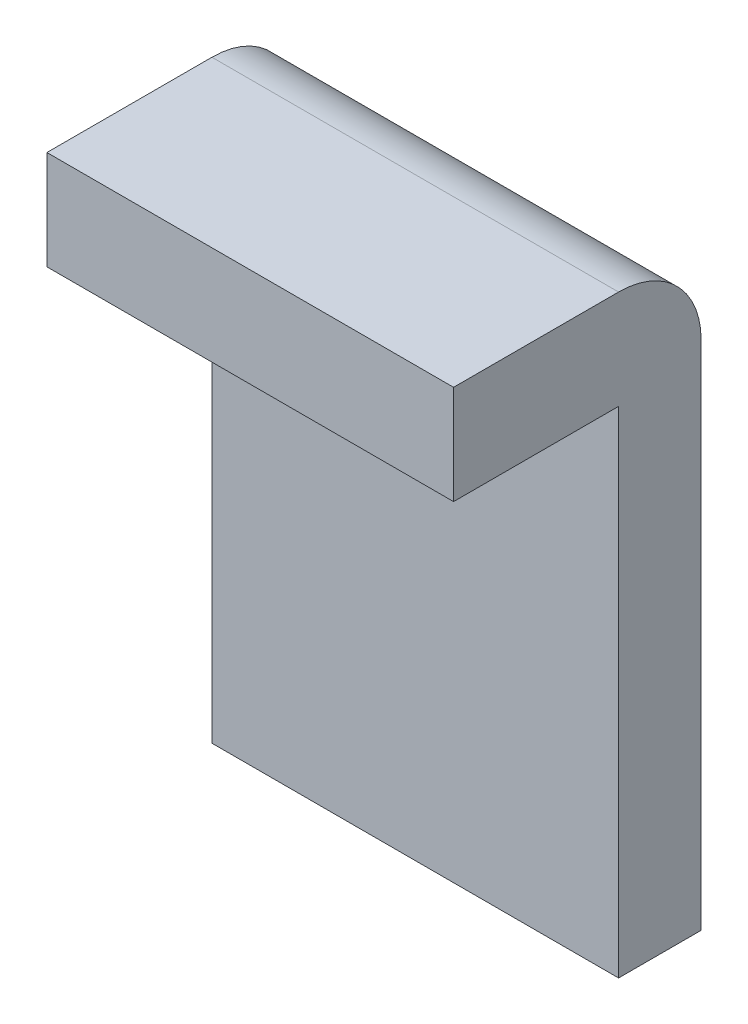
ISO-10303-21;
HEADER;
FILE_DESCRIPTION(('STEP AP214'),'2;1');
FILE_NAME('part.step','',(''),(''),'','','');
FILE_SCHEMA(('AUTOMOTIVE_DESIGN { 1 0 10303 214 1 1 1 1 }'));
ENDSEC;
DATA;
#1=APPLICATION_CONTEXT('core data for automotive mechanical design processes');
#2=APPLICATION_PROTOCOL_DEFINITION('international standard','automotive_design',2000,#1);
#3=PRODUCT_CONTEXT('',#1,'mechanical');
#4=PRODUCT('Part','Part','',(#3));
#5=PRODUCT_RELATED_PRODUCT_CATEGORY('part','',(#4));
#6=PRODUCT_DEFINITION_FORMATION('','',#4);
#7=PRODUCT_DEFINITION_CONTEXT('part definition',#1,'design');
#8=PRODUCT_DEFINITION('design','',#6,#7);
#9=PRODUCT_DEFINITION_SHAPE('','',#8);
#10=(LENGTH_UNIT() NAMED_UNIT(*) SI_UNIT(.MILLI.,.METRE.));
#11=(NAMED_UNIT(*) PLANE_ANGLE_UNIT() SI_UNIT($,.RADIAN.));
#12=(NAMED_UNIT(*) SI_UNIT($,.STERADIAN.) SOLID_ANGLE_UNIT());
#13=UNCERTAINTY_MEASURE_WITH_UNIT(LENGTH_MEASURE(1.E-05),#10,'distance_accuracy_value','');
#14=(GEOMETRIC_REPRESENTATION_CONTEXT(3) GLOBAL_UNCERTAINTY_ASSIGNED_CONTEXT((#13)) GLOBAL_UNIT_ASSIGNED_CONTEXT((#10,
#11,#12)) REPRESENTATION_CONTEXT('',''));
#15=CARTESIAN_POINT('',(0.,0.,0.));
#16=DIRECTION('',(0.,0.,1.));
#17=DIRECTION('',(1.,0.,0.));
#18=AXIS2_PLACEMENT_3D('',#15,#16,#17);
#19=CARTESIAN_POINT('',(-8.34906661620967,8.30000000000001,4.25467377707551));
#20=DIRECTION('',(0.,1.,0.));
#21=DIRECTION('',(0.,0.,1.));
#22=AXIS2_PLACEMENT_3D('',#19,#20,#21);
#23=PLANE('',#22);
#24=DIRECTION('',(1.,0.,0.));
#25=VECTOR('',#24,1.);
#26=CARTESIAN_POINT('',(11.6728048391445,8.30000000000001,4.25467377707552));
#27=LINE('',#26,#25);
#28=CARTESIAN_POINT('',(11.6728048391445,8.30000000000001,4.25467377707551));
#29=VERTEX_POINT('',#28);
#30=CARTESIAN_POINT('',(12.9049555955852,8.30000000000001,4.25467377707551));
#31=VERTEX_POINT('',#30);
#32=EDGE_CURVE('E133',#29,#31,#27,.T.);
#33=ORIENTED_EDGE('',*,*,#32,.F.);
#34=DIRECTION('',(0.,0.,1.));
#35=VECTOR('',#34,1.);
#36=CARTESIAN_POINT('',(11.6728048391445,8.30000000000001,4.25467377707553));
#37=LINE('',#36,#35);
#38=CARTESIAN_POINT('',(11.6728048391445,8.30000000000001,3.75467377707551));
#39=VERTEX_POINT('',#38);
#40=EDGE_CURVE('E113',#39,#29,#37,.T.);
#41=ORIENTED_EDGE('',*,*,#40,.F.);
#42=DIRECTION('',(1.,0.,0.));
#43=VECTOR('',#42,1.);
#44=CARTESIAN_POINT('',(-8.34906661620967,8.30000000000001,3.75467377707551));
#45=LINE('',#44,#43);
#46=CARTESIAN_POINT('',(12.9049555955852,8.30000000000001,3.75467377707551));
#47=VERTEX_POINT('',#46);
#48=EDGE_CURVE('E130',#39,#47,#45,.T.);
#49=ORIENTED_EDGE('',*,*,#48,.T.);
#50=DIRECTION('',(0.,0.,-1.));
#51=VECTOR('',#50,1.);
#52=CARTESIAN_POINT('',(12.9049555955852,8.30000000000001,4.25467377707553));
#53=LINE('',#52,#51);
#54=EDGE_CURVE('E129',#31,#47,#53,.T.);
#55=ORIENTED_EDGE('',*,*,#54,.F.);
#56=EDGE_LOOP('',(#33,#41,#49,#55));
#57=FACE_BOUND('',#56,.T.);
#58=ADVANCED_FACE('F17',(#57),#23,.F.);
#59=CARTESIAN_POINT('',(11.6728048391445,5.35753839337144,4.25467377707553));
#60=DIRECTION('',(0.,0.,1.));
#61=DIRECTION('',(0.,-1.,0.));
#62=AXIS2_PLACEMENT_3D('',#59,#60,#61);
#63=PLANE('',#62);
#64=DIRECTION('',(1.,0.,0.));
#65=VECTOR('',#64,1.);
#66=CARTESIAN_POINT('',(-8.34906661620967,8.6,4.25467377707551));
#67=LINE('',#66,#65);
#68=CARTESIAN_POINT('',(12.9049555955852,8.6,4.25467377707551));
#69=VERTEX_POINT('',#68);
#70=CARTESIAN_POINT('',(11.6728048391445,8.6,4.25467377707551));
#71=VERTEX_POINT('',#70);
#72=EDGE_CURVE('E131',#69,#71,#67,.F.);
#73=ORIENTED_EDGE('',*,*,#72,.T.);
#74=DIRECTION('',(0.,1.,0.));
#75=VECTOR('',#74,1.);
#76=CARTESIAN_POINT('',(11.6728048391445,5.35753839337144,4.25467377707551));
#77=LINE('',#76,#75);
#78=EDGE_CURVE('E136',#29,#71,#77,.T.);
#79=ORIENTED_EDGE('',*,*,#78,.F.);
#80=ORIENTED_EDGE('',*,*,#32,.T.);
#81=DIRECTION('',(0.,1.,0.));
#82=VECTOR('',#81,1.);
#83=CARTESIAN_POINT('',(12.9049555955852,5.35753839337144,4.25467377707551));
#84=LINE('',#83,#82);
#85=EDGE_CURVE('E120',#69,#31,#84,.F.);
#86=ORIENTED_EDGE('',*,*,#85,.F.);
#87=EDGE_LOOP('',(#73,#79,#80,#86));
#88=FACE_BOUND('',#87,.T.);
#89=ADVANCED_FACE('F172',(#88),#63,.T.);
#90=CARTESIAN_POINT('',(-8.34906661620967,8.6,4.25467377707551));
#91=DIRECTION('',(0.,-1.,0.));
#92=DIRECTION('',(0.,0.,-1.));
#93=AXIS2_PLACEMENT_3D('',#90,#91,#92);
#94=PLANE('',#93);
#95=DIRECTION('',(1.,0.,0.));
#96=VECTOR('',#95,1.);
#97=CARTESIAN_POINT('',(-8.34906661620967,8.6,3.75467377707551));
#98=LINE('',#97,#96);
#99=CARTESIAN_POINT('',(11.6728048391445,8.6,3.7546737770755));
#100=VERTEX_POINT('',#99);
#101=CARTESIAN_POINT('',(12.9049555955852,8.6,3.7546737770755));
#102=VERTEX_POINT('',#101);
#103=EDGE_CURVE('E79',#100,#102,#98,.T.);
#104=ORIENTED_EDGE('',*,*,#103,.F.);
#105=DIRECTION('',(0.,0.,1.));
#106=VECTOR('',#105,1.);
#107=CARTESIAN_POINT('',(11.6728048391445,8.6,4.25467377707553));
#108=LINE('',#107,#106);
#109=EDGE_CURVE('E139',#71,#100,#108,.F.);
#110=ORIENTED_EDGE('',*,*,#109,.F.);
#111=ORIENTED_EDGE('',*,*,#72,.F.);
#112=DIRECTION('',(0.,0.,-1.));
#113=VECTOR('',#112,1.);
#114=CARTESIAN_POINT('',(12.9049555955852,8.6,4.25467377707553));
#115=LINE('',#114,#113);
#116=EDGE_CURVE('E83',#102,#69,#115,.F.);
#117=ORIENTED_EDGE('',*,*,#116,.F.);
#118=EDGE_LOOP('',(#104,#110,#111,#117));
#119=FACE_BOUND('',#118,.T.);
#120=ADVANCED_FACE('F169',(#119),#94,.F.);
#121=CARTESIAN_POINT('',(-8.34906661620967,8.30000000000001,3.75467377707551));
#122=DIRECTION('',(0.,0.,-1.));
#123=DIRECTION('',(0.,1.,0.));
#124=AXIS2_PLACEMENT_3D('',#121,#122,#123);
#125=PLANE('',#124);
#126=ORIENTED_EDGE('',*,*,#48,.F.);
#127=DIRECTION('',(0.,1.,0.));
#128=VECTOR('',#127,1.);
#129=CARTESIAN_POINT('',(11.6728048391445,5.35753839337144,3.75467377707551));
#130=LINE('',#129,#128);
#131=CARTESIAN_POINT('',(11.6728048391445,6.8,3.75467377707551));
#132=VERTEX_POINT('',#131);
#133=EDGE_CURVE('E95',#132,#39,#130,.T.);
#134=ORIENTED_EDGE('',*,*,#133,.F.);
#135=DIRECTION('',(1.,0.,0.));
#136=VECTOR('',#135,1.);
#137=CARTESIAN_POINT('',(-15.8147962412963,6.8,3.75467377707551));
#138=LINE('',#137,#136);
#139=CARTESIAN_POINT('',(12.9049555955852,6.8,3.75467377707551));
#140=VERTEX_POINT('',#139);
#141=EDGE_CURVE('E114',#140,#132,#138,.F.);
#142=ORIENTED_EDGE('',*,*,#141,.F.);
#143=DIRECTION('',(0.,1.,0.));
#144=VECTOR('',#143,1.);
#145=CARTESIAN_POINT('',(12.9049555955852,5.35753839337144,3.75467377707551));
#146=LINE('',#145,#144);
#147=EDGE_CURVE('E84',#47,#140,#146,.F.);
#148=ORIENTED_EDGE('',*,*,#147,.F.);
#149=EDGE_LOOP('',(#126,#134,#142,#148));
#150=FACE_BOUND('',#149,.T.);
#151=ADVANCED_FACE('F178',(#150),#125,.F.);
#152=CARTESIAN_POINT('',(-8.34906661620967,8.35,3.7546737770755));
#153=DIRECTION('',(1.,0.,0.));
#154=DIRECTION('',(0.,0.,-1.));
#155=AXIS2_PLACEMENT_3D('',#152,#153,#154);
#156=CYLINDRICAL_SURFACE('',#155,0.249999999999996);
#157=CARTESIAN_POINT('',(11.6728048391445,8.35,3.7546737770755));
#158=DIRECTION('',(1.,0.,0.));
#159=DIRECTION('',(0.,0.,-1.));
#160=AXIS2_PLACEMENT_3D('',#157,#158,#159);
#161=CIRCLE('',#160,0.249999999999996);
#162=CARTESIAN_POINT('',(11.6728048391445,8.35,3.50467377707551));
#163=VERTEX_POINT('',#162);
#164=EDGE_CURVE('E106',#100,#163,#161,.F.);
#165=ORIENTED_EDGE('',*,*,#164,.F.);
#166=ORIENTED_EDGE('',*,*,#103,.T.);
#167=CARTESIAN_POINT('',(12.9049555955852,8.35,3.7546737770755));
#168=DIRECTION('',(1.,0.,0.));
#169=DIRECTION('',(0.,0.,-1.));
#170=AXIS2_PLACEMENT_3D('',#167,#168,#169);
#171=CIRCLE('',#170,0.249999999999996);
#172=CARTESIAN_POINT('',(12.9049555955852,8.35,3.50467377707551));
#173=VERTEX_POINT('',#172);
#174=EDGE_CURVE('E20',#173,#102,#171,.T.);
#175=ORIENTED_EDGE('',*,*,#174,.F.);
#176=DIRECTION('',(1.,0.,0.));
#177=VECTOR('',#176,1.);
#178=CARTESIAN_POINT('',(11.6728048391445,8.35,3.50467377707551));
#179=LINE('',#178,#177);
#180=EDGE_CURVE('E77',#163,#173,#179,.T.);
#181=ORIENTED_EDGE('',*,*,#180,.F.);
#182=EDGE_LOOP('',(#165,#166,#175,#181));
#183=FACE_BOUND('',#182,.T.);
#184=ADVANCED_FACE('F75',(#183),#156,.T.);
#185=CARTESIAN_POINT('',(12.9049555955852,5.35753839337144,4.25467377707553));
#186=DIRECTION('',(1.,0.,0.));
#187=DIRECTION('',(0.,0.,-1.));
#188=AXIS2_PLACEMENT_3D('',#185,#186,#187);
#189=PLANE('',#188);
#190=ORIENTED_EDGE('',*,*,#116,.T.);
#191=ORIENTED_EDGE('',*,*,#85,.T.);
#192=ORIENTED_EDGE('',*,*,#54,.T.);
#193=ORIENTED_EDGE('',*,*,#147,.T.);
#194=DIRECTION('',(0.,0.,-1.));
#195=VECTOR('',#194,1.);
#196=CARTESIAN_POINT('',(12.9049555955852,6.80000000000003,12.5046737770755));
#197=LINE('',#196,#195);
#198=CARTESIAN_POINT('',(12.9049555955852,6.8,3.50467377707552));
#199=VERTEX_POINT('',#198);
#200=EDGE_CURVE('E90',#199,#140,#197,.F.);
#201=ORIENTED_EDGE('',*,*,#200,.F.);
#202=DIRECTION('',(0.,1.,0.));
#203=VECTOR('',#202,1.);
#204=CARTESIAN_POINT('',(12.9049555955852,5.35753839337143,3.50467377707553));
#205=LINE('',#204,#203);
#206=EDGE_CURVE('E86',#173,#199,#205,.F.);
#207=ORIENTED_EDGE('',*,*,#206,.F.);
#208=ORIENTED_EDGE('',*,*,#174,.T.);
#209=EDGE_LOOP('',(#190,#191,#192,#193,#201,#207,#208));
#210=FACE_BOUND('',#209,.T.);
#211=ADVANCED_FACE('F87',(#210),#189,.T.);
#212=CARTESIAN_POINT('',(-15.8147962412963,6.80000000000003,12.5046737770755));
#213=DIRECTION('',(0.,-1.,0.));
#214=DIRECTION('',(0.,0.,-1.));
#215=AXIS2_PLACEMENT_3D('',#212,#213,#214);
#216=PLANE('',#215);
#217=DIRECTION('',(1.,0.,0.));
#218=VECTOR('',#217,1.);
#219=CARTESIAN_POINT('',(11.6728048391445,6.8,3.50467377707552));
#220=LINE('',#219,#218);
#221=CARTESIAN_POINT('',(11.6728048391445,6.8,3.50467377707552));
#222=VERTEX_POINT('',#221);
#223=EDGE_CURVE('E26',#199,#222,#220,.F.);
#224=ORIENTED_EDGE('',*,*,#223,.F.);
#225=ORIENTED_EDGE('',*,*,#200,.T.);
#226=ORIENTED_EDGE('',*,*,#141,.T.);
#227=DIRECTION('',(0.,0.,1.));
#228=VECTOR('',#227,1.);
#229=CARTESIAN_POINT('',(11.6728048391445,6.8,4.25467377707553));
#230=LINE('',#229,#228);
#231=EDGE_CURVE('E35',#222,#132,#230,.T.);
#232=ORIENTED_EDGE('',*,*,#231,.F.);
#233=EDGE_LOOP('',(#224,#225,#226,#232));
#234=FACE_BOUND('',#233,.T.);
#235=ADVANCED_FACE('F179',(#234),#216,.T.);
#236=CARTESIAN_POINT('',(11.6728048391445,5.35753839337144,4.25467377707553));
#237=DIRECTION('',(-1.,0.,0.));
#238=DIRECTION('',(0.,0.,1.));
#239=AXIS2_PLACEMENT_3D('',#236,#237,#238);
#240=PLANE('',#239);
#241=ORIENTED_EDGE('',*,*,#231,.T.);
#242=ORIENTED_EDGE('',*,*,#133,.T.);
#243=ORIENTED_EDGE('',*,*,#40,.T.);
#244=ORIENTED_EDGE('',*,*,#78,.T.);
#245=ORIENTED_EDGE('',*,*,#109,.T.);
#246=ORIENTED_EDGE('',*,*,#164,.T.);
#247=DIRECTION('',(0.,1.,0.));
#248=VECTOR('',#247,1.);
#249=CARTESIAN_POINT('',(11.6728048391445,5.35753839337143,3.50467377707553));
#250=LINE('',#249,#248);
#251=EDGE_CURVE('E11',#222,#163,#250,.T.);
#252=ORIENTED_EDGE('',*,*,#251,.F.);
#253=EDGE_LOOP('',(#241,#242,#243,#244,#245,#246,#252));
#254=FACE_BOUND('',#253,.T.);
#255=ADVANCED_FACE('F166',(#254),#240,.T.);
#256=CARTESIAN_POINT('',(11.6728048391445,5.35753839337143,3.50467377707553));
#257=DIRECTION('',(0.,0.,-1.));
#258=DIRECTION('',(0.,1.,0.));
#259=AXIS2_PLACEMENT_3D('',#256,#257,#258);
#260=PLANE('',#259);
#261=ORIENTED_EDGE('',*,*,#223,.T.);
#262=ORIENTED_EDGE('',*,*,#251,.T.);
#263=ORIENTED_EDGE('',*,*,#180,.T.);
#264=ORIENTED_EDGE('',*,*,#206,.T.);
#265=EDGE_LOOP('',(#261,#262,#263,#264));
#266=FACE_BOUND('',#265,.T.);
#267=ADVANCED_FACE('F94',(#266),#260,.T.);
#268=CLOSED_SHELL('',(#58,#89,#120,#151,#184,#211,#235,#255,#267));
#269=MANIFOLD_SOLID_BREP('B1',#268);
#270=ADVANCED_BREP_SHAPE_REPRESENTATION('',(#18,#269),#14);
#271=SHAPE_DEFINITION_REPRESENTATION(#9,#270);
ENDSEC;
END-ISO-10303-21;
